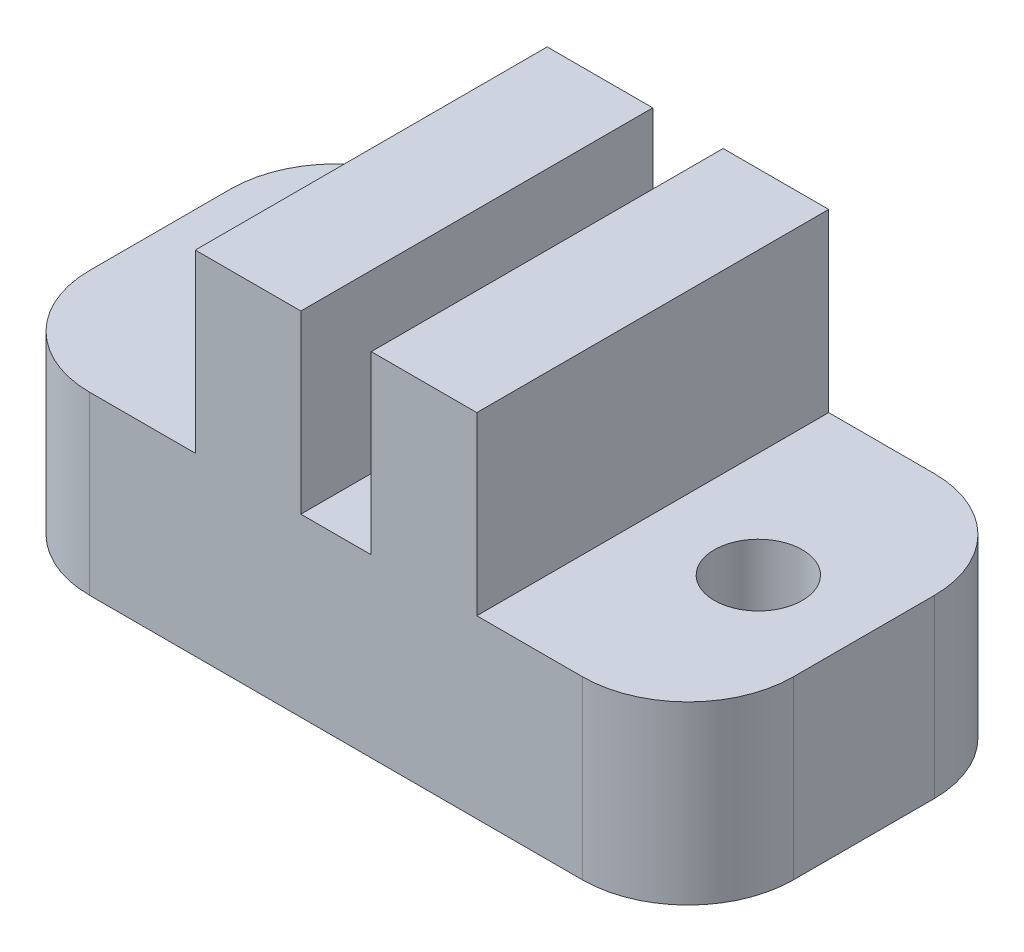
ISO-10303-21;
HEADER;
FILE_DESCRIPTION(('STEP AP214'),'2;1');
FILE_NAME('part.step','',(''),(''),'','','');
FILE_SCHEMA(('AUTOMOTIVE_DESIGN { 1 0 10303 214 1 1 1 1 }'));
ENDSEC;
DATA;
#1=APPLICATION_CONTEXT('core data for automotive mechanical design processes');
#2=APPLICATION_PROTOCOL_DEFINITION('international standard','automotive_design',2000,#1);
#3=PRODUCT_CONTEXT('',#1,'mechanical');
#4=PRODUCT('Part','Part','',(#3));
#5=PRODUCT_RELATED_PRODUCT_CATEGORY('part','',(#4));
#6=PRODUCT_DEFINITION_FORMATION('','',#4);
#7=PRODUCT_DEFINITION_CONTEXT('part definition',#1,'design');
#8=PRODUCT_DEFINITION('design','',#6,#7);
#9=PRODUCT_DEFINITION_SHAPE('','',#8);
#10=(LENGTH_UNIT() NAMED_UNIT(*) SI_UNIT(.MILLI.,.METRE.));
#11=(NAMED_UNIT(*) PLANE_ANGLE_UNIT() SI_UNIT($,.RADIAN.));
#12=(NAMED_UNIT(*) SI_UNIT($,.STERADIAN.) SOLID_ANGLE_UNIT());
#13=UNCERTAINTY_MEASURE_WITH_UNIT(LENGTH_MEASURE(1.E-05),#10,'distance_accuracy_value','');
#14=(GEOMETRIC_REPRESENTATION_CONTEXT(3) GLOBAL_UNCERTAINTY_ASSIGNED_CONTEXT((#13)) GLOBAL_UNIT_ASSIGNED_CONTEXT((#10,
#11,#12)) REPRESENTATION_CONTEXT('',''));
#15=CARTESIAN_POINT('',(0.,0.,0.));
#16=DIRECTION('',(0.,0.,1.));
#17=DIRECTION('',(1.,0.,0.));
#18=AXIS2_PLACEMENT_3D('',#15,#16,#17);
#19=CARTESIAN_POINT('',(0.,5.,0.));
#20=DIRECTION('',(0.,-1.,0.));
#21=DIRECTION('',(0.,0.,-1.));
#22=AXIS2_PLACEMENT_3D('',#19,#20,#21);
#23=PLANE('',#22);
#24=DIRECTION('',(0.,0.,1.));
#25=VECTOR('',#24,1.);
#26=CARTESIAN_POINT('',(11.,5.,-10.));
#27=LINE('',#26,#25);
#28=CARTESIAN_POINT('',(11.,5.,-10.));
#29=VERTEX_POINT('',#28);
#30=CARTESIAN_POINT('',(11.,5.,0.));
#31=VERTEX_POINT('',#30);
#32=EDGE_CURVE('E174',#29,#31,#27,.T.);
#33=ORIENTED_EDGE('',*,*,#32,.F.);
#34=DIRECTION('',(-1.,0.,0.));
#35=VECTOR('',#34,1.);
#36=CARTESIAN_POINT('',(0.,5.,-10.));
#37=LINE('',#36,#35);
#38=CARTESIAN_POINT('',(9.,5.,-10.));
#39=VERTEX_POINT('',#38);
#40=EDGE_CURVE('E207',#29,#39,#37,.T.);
#41=ORIENTED_EDGE('',*,*,#40,.T.);
#42=DIRECTION('',(0.,0.,-1.));
#43=VECTOR('',#42,1.);
#44=CARTESIAN_POINT('',(9.,5.,-10.));
#45=LINE('',#44,#43);
#46=CARTESIAN_POINT('',(9.,5.,0.));
#47=VERTEX_POINT('',#46);
#48=EDGE_CURVE('E178',#47,#39,#45,.T.);
#49=ORIENTED_EDGE('',*,*,#48,.F.);
#50=DIRECTION('',(1.,0.,0.));
#51=VECTOR('',#50,1.);
#52=CARTESIAN_POINT('',(0.,5.,0.));
#53=LINE('',#52,#51);
#54=EDGE_CURVE('E240',#47,#31,#53,.T.);
#55=ORIENTED_EDGE('',*,*,#54,.T.);
#56=EDGE_LOOP('',(#33,#41,#49,#55));
#57=FACE_BOUND('',#56,.T.);
#58=ADVANCED_FACE('F33',(#57),#23,.F.);
#59=CARTESIAN_POINT('',(17.,5.,-5.));
#60=DIRECTION('',(0.,1.,0.));
#61=DIRECTION('',(0.,0.,1.));
#62=AXIS2_PLACEMENT_3D('',#59,#60,#61);
#63=CIRCLE('',#62,1.25);
#64=CARTESIAN_POINT('',(17.,5.,-3.75));
#65=VERTEX_POINT('',#64);
#66=EDGE_CURVE('E267',#65,#65,#63,.T.);
#67=ORIENTED_EDGE('',*,*,#66,.F.);
#68=EDGE_LOOP('',(#67));
#69=FACE_BOUND('',#68,.T.);
#70=DIRECTION('',(0.,0.,-1.));
#71=VECTOR('',#70,1.);
#72=CARTESIAN_POINT('',(20.,5.,0.));
#73=LINE('',#72,#71);
#74=CARTESIAN_POINT('',(20.,5.,-3.));
#75=VERTEX_POINT('',#74);
#76=CARTESIAN_POINT('',(20.,5.,-7.));
#77=VERTEX_POINT('',#76);
#78=EDGE_CURVE('E218',#75,#77,#73,.T.);
#79=ORIENTED_EDGE('',*,*,#78,.T.);
#80=CARTESIAN_POINT('',(17.,5.,-7.));
#81=DIRECTION('',(0.,-1.,0.));
#82=DIRECTION('',(0.,0.,-1.));
#83=AXIS2_PLACEMENT_3D('',#80,#81,#82);
#84=CIRCLE('',#83,3.);
#85=CARTESIAN_POINT('',(17.,5.,-10.));
#86=VERTEX_POINT('',#85);
#87=EDGE_CURVE('E284',#77,#86,#84,.F.);
#88=ORIENTED_EDGE('',*,*,#87,.T.);
#89=CARTESIAN_POINT('',(14.,5.,-10.));
#90=VERTEX_POINT('',#89);
#91=EDGE_CURVE('E210',#86,#90,#37,.T.);
#92=ORIENTED_EDGE('',*,*,#91,.T.);
#93=DIRECTION('',(0.,0.,-1.));
#94=VECTOR('',#93,1.);
#95=CARTESIAN_POINT('',(14.,5.,-10.));
#96=LINE('',#95,#94);
#97=CARTESIAN_POINT('',(14.,5.,0.));
#98=VERTEX_POINT('',#97);
#99=EDGE_CURVE('E170',#98,#90,#96,.T.);
#100=ORIENTED_EDGE('',*,*,#99,.F.);
#101=CARTESIAN_POINT('',(17.,5.,0.));
#102=VERTEX_POINT('',#101);
#103=EDGE_CURVE('E212',#98,#102,#53,.T.);
#104=ORIENTED_EDGE('',*,*,#103,.T.);
#105=CARTESIAN_POINT('',(17.,5.,-3.));
#106=DIRECTION('',(0.,-1.,0.));
#107=DIRECTION('',(0.,0.,-1.));
#108=AXIS2_PLACEMENT_3D('',#105,#106,#107);
#109=CIRCLE('',#108,3.);
#110=EDGE_CURVE('E287',#102,#75,#109,.F.);
#111=ORIENTED_EDGE('',*,*,#110,.T.);
#112=EDGE_LOOP('',(#79,#88,#92,#100,#104,#111));
#113=FACE_BOUND('',#112,.T.);
#114=ADVANCED_FACE('F278',(#69,#113),#23,.F.);
#115=CARTESIAN_POINT('',(3.,5.,-5.));
#116=DIRECTION('',(0.,1.,0.));
#117=DIRECTION('',(0.,0.,1.));
#118=AXIS2_PLACEMENT_3D('',#115,#116,#117);
#119=CIRCLE('',#118,1.25);
#120=CARTESIAN_POINT('',(3.,5.,-3.75));
#121=VERTEX_POINT('',#120);
#122=EDGE_CURVE('E256',#121,#121,#119,.T.);
#123=ORIENTED_EDGE('',*,*,#122,.F.);
#124=EDGE_LOOP('',(#123));
#125=FACE_BOUND('',#124,.T.);
#126=CARTESIAN_POINT('',(6.,5.,-10.));
#127=VERTEX_POINT('',#126);
#128=CARTESIAN_POINT('',(3.,5.,-10.));
#129=VERTEX_POINT('',#128);
#130=EDGE_CURVE('E211',#127,#129,#37,.T.);
#131=ORIENTED_EDGE('',*,*,#130,.T.);
#132=CARTESIAN_POINT('',(3.,5.,-7.));
#133=DIRECTION('',(0.,-1.,0.));
#134=DIRECTION('',(0.,0.,-1.));
#135=AXIS2_PLACEMENT_3D('',#132,#133,#134);
#136=CIRCLE('',#135,3.);
#137=CARTESIAN_POINT('',(0.,5.,-7.));
#138=VERTEX_POINT('',#137);
#139=EDGE_CURVE('E298',#129,#138,#136,.F.);
#140=ORIENTED_EDGE('',*,*,#139,.T.);
#141=DIRECTION('',(0.,0.,1.));
#142=VECTOR('',#141,1.);
#143=CARTESIAN_POINT('',(0.,5.,0.));
#144=LINE('',#143,#142);
#145=CARTESIAN_POINT('',(0.,5.,-3.));
#146=VERTEX_POINT('',#145);
#147=EDGE_CURVE('E244',#138,#146,#144,.T.);
#148=ORIENTED_EDGE('',*,*,#147,.T.);
#149=CARTESIAN_POINT('',(3.,5.,-3.));
#150=DIRECTION('',(0.,-1.,0.));
#151=DIRECTION('',(0.,0.,-1.));
#152=AXIS2_PLACEMENT_3D('',#149,#150,#151);
#153=CIRCLE('',#152,3.);
#154=CARTESIAN_POINT('',(3.,5.,0.));
#155=VERTEX_POINT('',#154);
#156=EDGE_CURVE('E237',#146,#155,#153,.F.);
#157=ORIENTED_EDGE('',*,*,#156,.T.);
#158=CARTESIAN_POINT('',(6.,5.,0.));
#159=VERTEX_POINT('',#158);
#160=EDGE_CURVE('E238',#155,#159,#53,.T.);
#161=ORIENTED_EDGE('',*,*,#160,.T.);
#162=DIRECTION('',(0.,0.,1.));
#163=VECTOR('',#162,1.);
#164=CARTESIAN_POINT('',(6.,5.,-10.));
#165=LINE('',#164,#163);
#166=EDGE_CURVE('E175',#127,#159,#165,.T.);
#167=ORIENTED_EDGE('',*,*,#166,.F.);
#168=EDGE_LOOP('',(#131,#140,#148,#157,#161,#167));
#169=FACE_BOUND('',#168,.T.);
#170=ADVANCED_FACE('F281',(#125,#169),#23,.F.);
#171=CARTESIAN_POINT('',(0.,0.,0.));
#172=DIRECTION('',(0.,-1.,0.));
#173=DIRECTION('',(0.,0.,-1.));
#174=AXIS2_PLACEMENT_3D('',#171,#172,#173);
#175=PLANE('',#174);
#176=CARTESIAN_POINT('',(3.,0.,-5.));
#177=DIRECTION('',(0.,1.,0.));
#178=DIRECTION('',(0.,0.,1.));
#179=AXIS2_PLACEMENT_3D('',#176,#177,#178);
#180=CIRCLE('',#179,1.25);
#181=CARTESIAN_POINT('',(3.,0.,-3.75));
#182=VERTEX_POINT('',#181);
#183=EDGE_CURVE('E262',#182,#182,#180,.T.);
#184=ORIENTED_EDGE('',*,*,#183,.T.);
#185=EDGE_LOOP('',(#184));
#186=FACE_BOUND('',#185,.T.);
#187=DIRECTION('',(0.,0.,1.));
#188=VECTOR('',#187,1.);
#189=CARTESIAN_POINT('',(0.,0.,0.));
#190=LINE('',#189,#188);
#191=CARTESIAN_POINT('',(0.,0.,-7.));
#192=VERTEX_POINT('',#191);
#193=CARTESIAN_POINT('',(0.,0.,-3.));
#194=VERTEX_POINT('',#193);
#195=EDGE_CURVE('E219',#192,#194,#190,.T.);
#196=ORIENTED_EDGE('',*,*,#195,.F.);
#197=CARTESIAN_POINT('',(3.,0.,-7.));
#198=DIRECTION('',(0.,-1.,0.));
#199=DIRECTION('',(0.,0.,-1.));
#200=AXIS2_PLACEMENT_3D('',#197,#198,#199);
#201=CIRCLE('',#200,3.);
#202=CARTESIAN_POINT('',(3.,0.,-10.));
#203=VERTEX_POINT('',#202);
#204=EDGE_CURVE('E230',#192,#203,#201,.T.);
#205=ORIENTED_EDGE('',*,*,#204,.T.);
#206=DIRECTION('',(-1.,0.,0.));
#207=VECTOR('',#206,1.);
#208=CARTESIAN_POINT('',(0.,0.,-10.));
#209=LINE('',#208,#207);
#210=CARTESIAN_POINT('',(17.,0.,-10.));
#211=VERTEX_POINT('',#210);
#212=EDGE_CURVE('E249',#211,#203,#209,.T.);
#213=ORIENTED_EDGE('',*,*,#212,.F.);
#214=CARTESIAN_POINT('',(17.,0.,-7.));
#215=DIRECTION('',(0.,-1.,0.));
#216=DIRECTION('',(0.,0.,-1.));
#217=AXIS2_PLACEMENT_3D('',#214,#215,#216);
#218=CIRCLE('',#217,3.);
#219=CARTESIAN_POINT('',(20.,0.,-7.));
#220=VERTEX_POINT('',#219);
#221=EDGE_CURVE('E312',#211,#220,#218,.T.);
#222=ORIENTED_EDGE('',*,*,#221,.T.);
#223=DIRECTION('',(0.,0.,-1.));
#224=VECTOR('',#223,1.);
#225=CARTESIAN_POINT('',(20.,0.,0.));
#226=LINE('',#225,#224);
#227=CARTESIAN_POINT('',(20.,0.,-3.));
#228=VERTEX_POINT('',#227);
#229=EDGE_CURVE('E252',#228,#220,#226,.T.);
#230=ORIENTED_EDGE('',*,*,#229,.F.);
#231=CARTESIAN_POINT('',(17.,0.,-3.));
#232=DIRECTION('',(0.,-1.,0.));
#233=DIRECTION('',(0.,0.,-1.));
#234=AXIS2_PLACEMENT_3D('',#231,#232,#233);
#235=CIRCLE('',#234,3.);
#236=CARTESIAN_POINT('',(17.,0.,0.));
#237=VERTEX_POINT('',#236);
#238=EDGE_CURVE('E313',#228,#237,#235,.T.);
#239=ORIENTED_EDGE('',*,*,#238,.T.);
#240=DIRECTION('',(1.,0.,0.));
#241=VECTOR('',#240,1.);
#242=CARTESIAN_POINT('',(0.,0.,0.));
#243=LINE('',#242,#241);
#244=CARTESIAN_POINT('',(3.,0.,0.));
#245=VERTEX_POINT('',#244);
#246=EDGE_CURVE('E253',#245,#237,#243,.T.);
#247=ORIENTED_EDGE('',*,*,#246,.F.);
#248=CARTESIAN_POINT('',(3.,0.,-3.));
#249=DIRECTION('',(0.,-1.,0.));
#250=DIRECTION('',(0.,0.,-1.));
#251=AXIS2_PLACEMENT_3D('',#248,#249,#250);
#252=CIRCLE('',#251,3.);
#253=EDGE_CURVE('E310',#245,#194,#252,.T.);
#254=ORIENTED_EDGE('',*,*,#253,.T.);
#255=EDGE_LOOP('',(#196,#205,#213,#222,#230,#239,#247,#254));
#256=FACE_BOUND('',#255,.T.);
#257=CARTESIAN_POINT('',(17.,0.,-5.));
#258=DIRECTION('',(0.,1.,0.));
#259=DIRECTION('',(0.,0.,1.));
#260=AXIS2_PLACEMENT_3D('',#257,#258,#259);
#261=CIRCLE('',#260,1.25);
#262=CARTESIAN_POINT('',(17.,0.,-3.75));
#263=VERTEX_POINT('',#262);
#264=EDGE_CURVE('E269',#263,#263,#261,.T.);
#265=ORIENTED_EDGE('',*,*,#264,.T.);
#266=EDGE_LOOP('',(#265));
#267=FACE_BOUND('',#266,.T.);
#268=ADVANCED_FACE('F324',(#186,#256,#267),#175,.T.);
#269=CARTESIAN_POINT('',(0.,5.,0.));
#270=DIRECTION('',(1.,0.,0.));
#271=DIRECTION('',(0.,0.,-1.));
#272=AXIS2_PLACEMENT_3D('',#269,#270,#271);
#273=PLANE('',#272);
#274=ORIENTED_EDGE('',*,*,#147,.F.);
#275=DIRECTION('',(0.,-1.,0.));
#276=VECTOR('',#275,1.);
#277=CARTESIAN_POINT('',(0.,5.,-7.));
#278=LINE('',#277,#276);
#279=EDGE_CURVE('E315',#138,#192,#278,.T.);
#280=ORIENTED_EDGE('',*,*,#279,.T.);
#281=ORIENTED_EDGE('',*,*,#195,.T.);
#282=DIRECTION('',(0.,-1.,0.));
#283=VECTOR('',#282,1.);
#284=CARTESIAN_POINT('',(0.,5.,-3.));
#285=LINE('',#284,#283);
#286=EDGE_CURVE('E229',#194,#146,#285,.F.);
#287=ORIENTED_EDGE('',*,*,#286,.T.);
#288=EDGE_LOOP('',(#274,#280,#281,#287));
#289=FACE_BOUND('',#288,.T.);
#290=ADVANCED_FACE('F318',(#289),#273,.F.);
#291=CARTESIAN_POINT('',(0.,5.,0.));
#292=DIRECTION('',(0.,0.,-1.));
#293=DIRECTION('',(-1.,0.,0.));
#294=AXIS2_PLACEMENT_3D('',#291,#292,#293);
#295=PLANE('',#294);
#296=ORIENTED_EDGE('',*,*,#160,.F.);
#297=DIRECTION('',(0.,-1.,0.));
#298=VECTOR('',#297,1.);
#299=CARTESIAN_POINT('',(3.,5.,0.));
#300=LINE('',#299,#298);
#301=EDGE_CURVE('E11',#155,#245,#300,.T.);
#302=ORIENTED_EDGE('',*,*,#301,.T.);
#303=ORIENTED_EDGE('',*,*,#246,.T.);
#304=DIRECTION('',(0.,-1.,0.));
#305=VECTOR('',#304,1.);
#306=CARTESIAN_POINT('',(17.,5.,0.));
#307=LINE('',#306,#305);
#308=EDGE_CURVE('E41',#237,#102,#307,.F.);
#309=ORIENTED_EDGE('',*,*,#308,.T.);
#310=ORIENTED_EDGE('',*,*,#103,.F.);
#311=DIRECTION('',(0.,-1.,0.));
#312=VECTOR('',#311,1.);
#313=CARTESIAN_POINT('',(14.,10.,0.));
#314=LINE('',#313,#312);
#315=CARTESIAN_POINT('',(14.,10.,0.));
#316=VERTEX_POINT('',#315);
#317=EDGE_CURVE('E157',#316,#98,#314,.T.);
#318=ORIENTED_EDGE('',*,*,#317,.F.);
#319=DIRECTION('',(1.,0.,0.));
#320=VECTOR('',#319,1.);
#321=CARTESIAN_POINT('',(11.,10.,0.));
#322=LINE('',#321,#320);
#323=CARTESIAN_POINT('',(11.,10.,0.));
#324=VERTEX_POINT('',#323);
#325=EDGE_CURVE('E148',#324,#316,#322,.T.);
#326=ORIENTED_EDGE('',*,*,#325,.F.);
#327=DIRECTION('',(0.,-1.,0.));
#328=VECTOR('',#327,1.);
#329=CARTESIAN_POINT('',(11.,10.,0.));
#330=LINE('',#329,#328);
#331=EDGE_CURVE('E154',#324,#31,#330,.T.);
#332=ORIENTED_EDGE('',*,*,#331,.T.);
#333=ORIENTED_EDGE('',*,*,#54,.F.);
#334=DIRECTION('',(0.,-1.,0.));
#335=VECTOR('',#334,1.);
#336=CARTESIAN_POINT('',(9.,10.,0.));
#337=LINE('',#336,#335);
#338=CARTESIAN_POINT('',(9.,10.,0.));
#339=VERTEX_POINT('',#338);
#340=EDGE_CURVE('E347',#339,#47,#337,.T.);
#341=ORIENTED_EDGE('',*,*,#340,.F.);
#342=DIRECTION('',(1.,0.,0.));
#343=VECTOR('',#342,1.);
#344=CARTESIAN_POINT('',(6.,10.,0.));
#345=LINE('',#344,#343);
#346=CARTESIAN_POINT('',(6.,10.,0.));
#347=VERTEX_POINT('',#346);
#348=EDGE_CURVE('E187',#347,#339,#345,.T.);
#349=ORIENTED_EDGE('',*,*,#348,.F.);
#350=DIRECTION('',(0.,-1.,0.));
#351=VECTOR('',#350,1.);
#352=CARTESIAN_POINT('',(6.,10.,0.));
#353=LINE('',#352,#351);
#354=EDGE_CURVE('E271',#347,#159,#353,.T.);
#355=ORIENTED_EDGE('',*,*,#354,.T.);
#356=EDGE_LOOP('',(#296,#302,#303,#309,#310,#318,#326,#332,#333,#341,#349,#355));
#357=FACE_BOUND('',#356,.T.);
#358=ADVANCED_FACE('F151',(#357),#295,.F.);
#359=CARTESIAN_POINT('',(20.,5.,0.));
#360=DIRECTION('',(-1.,0.,0.));
#361=DIRECTION('',(0.,0.,1.));
#362=AXIS2_PLACEMENT_3D('',#359,#360,#361);
#363=PLANE('',#362);
#364=ORIENTED_EDGE('',*,*,#229,.T.);
#365=DIRECTION('',(0.,-1.,0.));
#366=VECTOR('',#365,1.);
#367=CARTESIAN_POINT('',(20.,5.,-7.));
#368=LINE('',#367,#366);
#369=EDGE_CURVE('E55',#220,#77,#368,.F.);
#370=ORIENTED_EDGE('',*,*,#369,.T.);
#371=ORIENTED_EDGE('',*,*,#78,.F.);
#372=DIRECTION('',(0.,-1.,0.));
#373=VECTOR('',#372,1.);
#374=CARTESIAN_POINT('',(20.,5.,-3.));
#375=LINE('',#374,#373);
#376=EDGE_CURVE('E297',#75,#228,#375,.T.);
#377=ORIENTED_EDGE('',*,*,#376,.T.);
#378=EDGE_LOOP('',(#364,#370,#371,#377));
#379=FACE_BOUND('',#378,.T.);
#380=ADVANCED_FACE('F390',(#379),#363,.F.);
#381=CARTESIAN_POINT('',(0.,5.,-10.));
#382=DIRECTION('',(0.,0.,1.));
#383=DIRECTION('',(1.,0.,0.));
#384=AXIS2_PLACEMENT_3D('',#381,#382,#383);
#385=PLANE('',#384);
#386=ORIENTED_EDGE('',*,*,#212,.T.);
#387=DIRECTION('',(0.,-1.,0.));
#388=VECTOR('',#387,1.);
#389=CARTESIAN_POINT('',(3.,5.,-10.));
#390=LINE('',#389,#388);
#391=EDGE_CURVE('E235',#203,#129,#390,.F.);
#392=ORIENTED_EDGE('',*,*,#391,.T.);
#393=ORIENTED_EDGE('',*,*,#130,.F.);
#394=DIRECTION('',(0.,-1.,0.));
#395=VECTOR('',#394,1.);
#396=CARTESIAN_POINT('',(6.,10.,-10.));
#397=LINE('',#396,#395);
#398=CARTESIAN_POINT('',(6.,10.,-10.));
#399=VERTEX_POINT('',#398);
#400=EDGE_CURVE('E193',#399,#127,#397,.T.);
#401=ORIENTED_EDGE('',*,*,#400,.F.);
#402=DIRECTION('',(-1.,0.,0.));
#403=VECTOR('',#402,1.);
#404=CARTESIAN_POINT('',(6.,10.,-10.));
#405=LINE('',#404,#403);
#406=CARTESIAN_POINT('',(9.,10.,-10.));
#407=VERTEX_POINT('',#406);
#408=EDGE_CURVE('E191',#407,#399,#405,.T.);
#409=ORIENTED_EDGE('',*,*,#408,.F.);
#410=DIRECTION('',(0.,-1.,0.));
#411=VECTOR('',#410,1.);
#412=CARTESIAN_POINT('',(9.,10.,-10.));
#413=LINE('',#412,#411);
#414=EDGE_CURVE('E204',#407,#39,#413,.T.);
#415=ORIENTED_EDGE('',*,*,#414,.T.);
#416=ORIENTED_EDGE('',*,*,#40,.F.);
#417=DIRECTION('',(0.,-1.,0.));
#418=VECTOR('',#417,1.);
#419=CARTESIAN_POINT('',(11.,10.,-10.));
#420=LINE('',#419,#418);
#421=CARTESIAN_POINT('',(11.,10.,-10.));
#422=VERTEX_POINT('',#421);
#423=EDGE_CURVE('E338',#422,#29,#420,.T.);
#424=ORIENTED_EDGE('',*,*,#423,.F.);
#425=DIRECTION('',(-1.,0.,0.));
#426=VECTOR('',#425,1.);
#427=CARTESIAN_POINT('',(11.,10.,-10.));
#428=LINE('',#427,#426);
#429=CARTESIAN_POINT('',(14.,10.,-10.));
#430=VERTEX_POINT('',#429);
#431=EDGE_CURVE('E166',#430,#422,#428,.T.);
#432=ORIENTED_EDGE('',*,*,#431,.F.);
#433=DIRECTION('',(0.,-1.,0.));
#434=VECTOR('',#433,1.);
#435=CARTESIAN_POINT('',(14.,10.,-10.));
#436=LINE('',#435,#434);
#437=EDGE_CURVE('E180',#430,#90,#436,.T.);
#438=ORIENTED_EDGE('',*,*,#437,.T.);
#439=ORIENTED_EDGE('',*,*,#91,.F.);
#440=DIRECTION('',(0.,-1.,0.));
#441=VECTOR('',#440,1.);
#442=CARTESIAN_POINT('',(17.,5.,-10.));
#443=LINE('',#442,#441);
#444=EDGE_CURVE('E232',#86,#211,#443,.T.);
#445=ORIENTED_EDGE('',*,*,#444,.T.);
#446=EDGE_LOOP('',(#386,#392,#393,#401,#409,#415,#416,#424,#432,#438,#439,#445));
#447=FACE_BOUND('',#446,.T.);
#448=ADVANCED_FACE('F327',(#447),#385,.F.);
#449=CARTESIAN_POINT('',(3.,5.,-5.));
#450=DIRECTION('',(0.,-1.,0.));
#451=DIRECTION('',(0.,0.,-1.));
#452=AXIS2_PLACEMENT_3D('',#449,#450,#451);
#453=CYLINDRICAL_SURFACE('',#452,1.25);
#454=ORIENTED_EDGE('',*,*,#122,.T.);
#455=EDGE_LOOP('',(#454));
#456=FACE_BOUND('',#455,.T.);
#457=ORIENTED_EDGE('',*,*,#183,.F.);
#458=EDGE_LOOP('',(#457));
#459=FACE_BOUND('',#458,.T.);
#460=ADVANCED_FACE('F370',(#456,#459),#453,.F.);
#461=CARTESIAN_POINT('',(17.,5.,-5.));
#462=DIRECTION('',(0.,-1.,0.));
#463=DIRECTION('',(0.,0.,-1.));
#464=AXIS2_PLACEMENT_3D('',#461,#462,#463);
#465=CYLINDRICAL_SURFACE('',#464,1.25);
#466=ORIENTED_EDGE('',*,*,#66,.T.);
#467=EDGE_LOOP('',(#466));
#468=FACE_BOUND('',#467,.T.);
#469=ORIENTED_EDGE('',*,*,#264,.F.);
#470=EDGE_LOOP('',(#469));
#471=FACE_BOUND('',#470,.T.);
#472=ADVANCED_FACE('F275',(#468,#471),#465,.F.);
#473=CARTESIAN_POINT('',(6.,10.,-10.));
#474=DIRECTION('',(1.,0.,0.));
#475=DIRECTION('',(0.,0.,-1.));
#476=AXIS2_PLACEMENT_3D('',#473,#474,#475);
#477=PLANE('',#476);
#478=ORIENTED_EDGE('',*,*,#166,.T.);
#479=ORIENTED_EDGE('',*,*,#354,.F.);
#480=DIRECTION('',(0.,0.,1.));
#481=VECTOR('',#480,1.);
#482=CARTESIAN_POINT('',(6.,10.,-10.));
#483=LINE('',#482,#481);
#484=EDGE_CURVE('E184',#399,#347,#483,.T.);
#485=ORIENTED_EDGE('',*,*,#484,.F.);
#486=ORIENTED_EDGE('',*,*,#400,.T.);
#487=EDGE_LOOP('',(#478,#479,#485,#486));
#488=FACE_BOUND('',#487,.T.);
#489=ADVANCED_FACE('F362',(#488),#477,.F.);
#490=CARTESIAN_POINT('',(9.,10.,-10.));
#491=DIRECTION('',(-1.,0.,0.));
#492=DIRECTION('',(0.,0.,1.));
#493=AXIS2_PLACEMENT_3D('',#490,#491,#492);
#494=PLANE('',#493);
#495=ORIENTED_EDGE('',*,*,#48,.T.);
#496=ORIENTED_EDGE('',*,*,#414,.F.);
#497=DIRECTION('',(0.,0.,-1.));
#498=VECTOR('',#497,1.);
#499=CARTESIAN_POINT('',(9.,10.,-10.));
#500=LINE('',#499,#498);
#501=EDGE_CURVE('E189',#339,#407,#500,.T.);
#502=ORIENTED_EDGE('',*,*,#501,.F.);
#503=ORIENTED_EDGE('',*,*,#340,.T.);
#504=EDGE_LOOP('',(#495,#496,#502,#503));
#505=FACE_BOUND('',#504,.T.);
#506=ADVANCED_FACE('F350',(#505),#494,.F.);
#507=CARTESIAN_POINT('',(0.,10.,0.));
#508=DIRECTION('',(0.,1.,0.));
#509=DIRECTION('',(0.,0.,1.));
#510=AXIS2_PLACEMENT_3D('',#507,#508,#509);
#511=PLANE('',#510);
#512=ORIENTED_EDGE('',*,*,#484,.T.);
#513=ORIENTED_EDGE('',*,*,#348,.T.);
#514=ORIENTED_EDGE('',*,*,#501,.T.);
#515=ORIENTED_EDGE('',*,*,#408,.T.);
#516=EDGE_LOOP('',(#512,#513,#514,#515));
#517=FACE_BOUND('',#516,.T.);
#518=ADVANCED_FACE('F358',(#517),#511,.T.);
#519=CARTESIAN_POINT('',(11.,10.,-10.));
#520=DIRECTION('',(1.,0.,0.));
#521=DIRECTION('',(0.,0.,-1.));
#522=AXIS2_PLACEMENT_3D('',#519,#520,#521);
#523=PLANE('',#522);
#524=ORIENTED_EDGE('',*,*,#32,.T.);
#525=ORIENTED_EDGE('',*,*,#331,.F.);
#526=DIRECTION('',(0.,0.,1.));
#527=VECTOR('',#526,1.);
#528=CARTESIAN_POINT('',(11.,10.,-10.));
#529=LINE('',#528,#527);
#530=EDGE_CURVE('E161',#422,#324,#529,.T.);
#531=ORIENTED_EDGE('',*,*,#530,.F.);
#532=ORIENTED_EDGE('',*,*,#423,.T.);
#533=EDGE_LOOP('',(#524,#525,#531,#532));
#534=FACE_BOUND('',#533,.T.);
#535=ADVANCED_FACE('F172',(#534),#523,.F.);
#536=CARTESIAN_POINT('',(14.,10.,-10.));
#537=DIRECTION('',(-1.,0.,0.));
#538=DIRECTION('',(0.,0.,1.));
#539=AXIS2_PLACEMENT_3D('',#536,#537,#538);
#540=PLANE('',#539);
#541=ORIENTED_EDGE('',*,*,#99,.T.);
#542=ORIENTED_EDGE('',*,*,#437,.F.);
#543=DIRECTION('',(0.,0.,-1.));
#544=VECTOR('',#543,1.);
#545=CARTESIAN_POINT('',(14.,10.,-10.));
#546=LINE('',#545,#544);
#547=EDGE_CURVE('E160',#316,#430,#546,.T.);
#548=ORIENTED_EDGE('',*,*,#547,.F.);
#549=ORIENTED_EDGE('',*,*,#317,.T.);
#550=EDGE_LOOP('',(#541,#542,#548,#549));
#551=FACE_BOUND('',#550,.T.);
#552=ADVANCED_FACE('F333',(#551),#540,.F.);
#553=CARTESIAN_POINT('',(0.,10.,0.));
#554=DIRECTION('',(0.,1.,0.));
#555=DIRECTION('',(0.,0.,1.));
#556=AXIS2_PLACEMENT_3D('',#553,#554,#555);
#557=PLANE('',#556);
#558=ORIENTED_EDGE('',*,*,#530,.T.);
#559=ORIENTED_EDGE('',*,*,#325,.T.);
#560=ORIENTED_EDGE('',*,*,#547,.T.);
#561=ORIENTED_EDGE('',*,*,#431,.T.);
#562=EDGE_LOOP('',(#558,#559,#560,#561));
#563=FACE_BOUND('',#562,.T.);
#564=ADVANCED_FACE('F164',(#563),#557,.T.);
#565=CARTESIAN_POINT('',(3.,5.,-7.));
#566=DIRECTION('',(0.,-1.,0.));
#567=DIRECTION('',(0.,0.,-1.));
#568=AXIS2_PLACEMENT_3D('',#565,#566,#567);
#569=CYLINDRICAL_SURFACE('',#568,3.);
#570=ORIENTED_EDGE('',*,*,#139,.F.);
#571=ORIENTED_EDGE('',*,*,#391,.F.);
#572=ORIENTED_EDGE('',*,*,#204,.F.);
#573=ORIENTED_EDGE('',*,*,#279,.F.);
#574=EDGE_LOOP('',(#570,#571,#572,#573));
#575=FACE_BOUND('',#574,.T.);
#576=ADVANCED_FACE('F321',(#575),#569,.T.);
#577=CARTESIAN_POINT('',(17.,5.,-7.));
#578=DIRECTION('',(0.,-1.,0.));
#579=DIRECTION('',(0.,0.,-1.));
#580=AXIS2_PLACEMENT_3D('',#577,#578,#579);
#581=CYLINDRICAL_SURFACE('',#580,3.);
#582=ORIENTED_EDGE('',*,*,#87,.F.);
#583=ORIENTED_EDGE('',*,*,#369,.F.);
#584=ORIENTED_EDGE('',*,*,#221,.F.);
#585=ORIENTED_EDGE('',*,*,#444,.F.);
#586=EDGE_LOOP('',(#582,#583,#584,#585));
#587=FACE_BOUND('',#586,.T.);
#588=ADVANCED_FACE('F292',(#587),#581,.T.);
#589=CARTESIAN_POINT('',(3.,5.,-3.));
#590=DIRECTION('',(0.,-1.,0.));
#591=DIRECTION('',(0.,0.,-1.));
#592=AXIS2_PLACEMENT_3D('',#589,#590,#591);
#593=CYLINDRICAL_SURFACE('',#592,3.);
#594=ORIENTED_EDGE('',*,*,#156,.F.);
#595=ORIENTED_EDGE('',*,*,#286,.F.);
#596=ORIENTED_EDGE('',*,*,#253,.F.);
#597=ORIENTED_EDGE('',*,*,#301,.F.);
#598=EDGE_LOOP('',(#594,#595,#596,#597));
#599=FACE_BOUND('',#598,.T.);
#600=ADVANCED_FACE('F309',(#599),#593,.T.);
#601=CARTESIAN_POINT('',(17.,5.,-3.));
#602=DIRECTION('',(0.,-1.,0.));
#603=DIRECTION('',(0.,0.,-1.));
#604=AXIS2_PLACEMENT_3D('',#601,#602,#603);
#605=CYLINDRICAL_SURFACE('',#604,3.);
#606=ORIENTED_EDGE('',*,*,#110,.F.);
#607=ORIENTED_EDGE('',*,*,#308,.F.);
#608=ORIENTED_EDGE('',*,*,#238,.F.);
#609=ORIENTED_EDGE('',*,*,#376,.F.);
#610=EDGE_LOOP('',(#606,#607,#608,#609));
#611=FACE_BOUND('',#610,.T.);
#612=ADVANCED_FACE('F35',(#611),#605,.T.);
#613=CLOSED_SHELL('',(#58,#114,#170,#268,#290,#358,#380,#448,#460,#472,#489,#506,#518,#535,#552,
#564,#576,#588,#600,#612));
#614=MANIFOLD_SOLID_BREP('B2',#613);
#615=ADVANCED_BREP_SHAPE_REPRESENTATION('',(#18,#614),#14);
#616=SHAPE_DEFINITION_REPRESENTATION(#9,#615);
ENDSEC;
END-ISO-10303-21;
